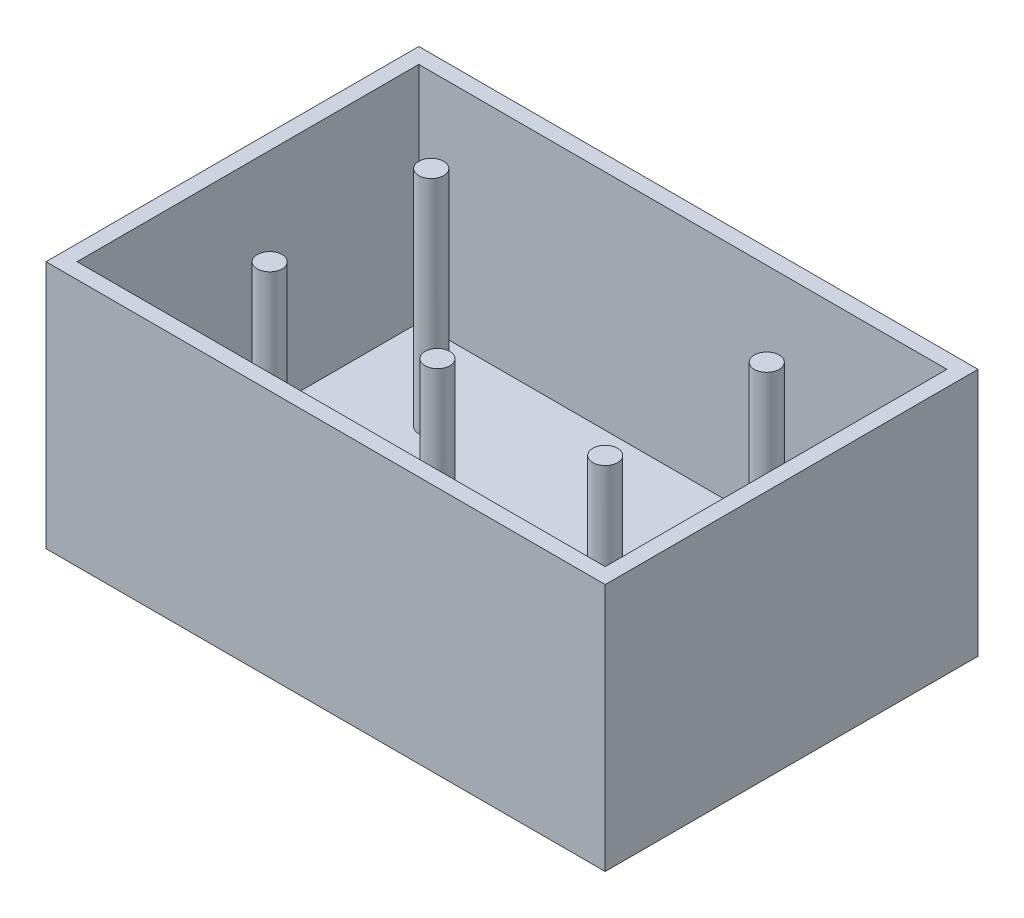
ISO-10303-21;
HEADER;
FILE_DESCRIPTION(('STEP AP214'),'2;1');
FILE_NAME('part.step','',(''),(''),'','','');
FILE_SCHEMA(('AUTOMOTIVE_DESIGN { 1 0 10303 214 1 1 1 1 }'));
ENDSEC;
DATA;
#1=APPLICATION_CONTEXT('core data for automotive mechanical design processes');
#2=APPLICATION_PROTOCOL_DEFINITION('international standard','automotive_design',2000,#1);
#3=PRODUCT_CONTEXT('',#1,'mechanical');
#4=PRODUCT('Part','Part','',(#3));
#5=PRODUCT_RELATED_PRODUCT_CATEGORY('part','',(#4));
#6=PRODUCT_DEFINITION_FORMATION('','',#4);
#7=PRODUCT_DEFINITION_CONTEXT('part definition',#1,'design');
#8=PRODUCT_DEFINITION('design','',#6,#7);
#9=PRODUCT_DEFINITION_SHAPE('','',#8);
#10=(LENGTH_UNIT() NAMED_UNIT(*) SI_UNIT(.MILLI.,.METRE.));
#11=(NAMED_UNIT(*) PLANE_ANGLE_UNIT() SI_UNIT($,.RADIAN.));
#12=(NAMED_UNIT(*) SI_UNIT($,.STERADIAN.) SOLID_ANGLE_UNIT());
#13=UNCERTAINTY_MEASURE_WITH_UNIT(LENGTH_MEASURE(1.E-05),#10,'distance_accuracy_value','');
#14=(GEOMETRIC_REPRESENTATION_CONTEXT(3) GLOBAL_UNCERTAINTY_ASSIGNED_CONTEXT((#13)) GLOBAL_UNIT_ASSIGNED_CONTEXT((#10,
#11,#12)) REPRESENTATION_CONTEXT('',''));
#15=CARTESIAN_POINT('',(0.,0.,0.));
#16=DIRECTION('',(0.,0.,1.));
#17=DIRECTION('',(1.,0.,0.));
#18=AXIS2_PLACEMENT_3D('',#15,#16,#17);
#19=CARTESIAN_POINT('',(57.15,25.4,38.1));
#20=DIRECTION('',(0.,0.,-1.));
#21=DIRECTION('',(-1.,0.,0.));
#22=AXIS2_PLACEMENT_3D('',#19,#20,#21);
#23=PLANE('',#22);
#24=DIRECTION('',(1.,0.,0.));
#25=VECTOR('',#24,1.);
#26=CARTESIAN_POINT('',(57.15,-25.4,38.1));
#27=LINE('',#26,#25);
#28=CARTESIAN_POINT('',(-57.15,-25.4,38.1));
#29=VERTEX_POINT('',#28);
#30=CARTESIAN_POINT('',(57.15,-25.4,38.1));
#31=VERTEX_POINT('',#30);
#32=EDGE_CURVE('E133',#29,#31,#27,.T.);
#33=ORIENTED_EDGE('',*,*,#32,.T.);
#34=DIRECTION('',(0.,-1.,0.));
#35=VECTOR('',#34,1.);
#36=CARTESIAN_POINT('',(57.15,25.4,38.1));
#37=LINE('',#36,#35);
#38=CARTESIAN_POINT('',(57.15,25.4,38.1));
#39=VERTEX_POINT('',#38);
#40=EDGE_CURVE('E175',#39,#31,#37,.T.);
#41=ORIENTED_EDGE('',*,*,#40,.F.);
#42=DIRECTION('',(1.,0.,0.));
#43=VECTOR('',#42,1.);
#44=CARTESIAN_POINT('',(57.15,25.4,38.1));
#45=LINE('',#44,#43);
#46=CARTESIAN_POINT('',(-57.15,25.4,38.1));
#47=VERTEX_POINT('',#46);
#48=EDGE_CURVE('E155',#47,#39,#45,.T.);
#49=ORIENTED_EDGE('',*,*,#48,.F.);
#50=DIRECTION('',(0.,-1.,0.));
#51=VECTOR('',#50,1.);
#52=CARTESIAN_POINT('',(-57.15,25.4,38.1));
#53=LINE('',#52,#51);
#54=EDGE_CURVE('E161',#47,#29,#53,.T.);
#55=ORIENTED_EDGE('',*,*,#54,.T.);
#56=EDGE_LOOP('',(#33,#41,#49,#55));
#57=FACE_BOUND('',#56,.T.);
#58=ADVANCED_FACE('F41',(#57),#23,.F.);
#59=CARTESIAN_POINT('',(57.15,25.4,38.1));
#60=DIRECTION('',(-1.,0.,0.));
#61=DIRECTION('',(0.,0.,1.));
#62=AXIS2_PLACEMENT_3D('',#59,#60,#61);
#63=PLANE('',#62);
#64=DIRECTION('',(0.,0.,-1.));
#65=VECTOR('',#64,1.);
#66=CARTESIAN_POINT('',(57.15,-25.4,38.1));
#67=LINE('',#66,#65);
#68=CARTESIAN_POINT('',(57.15,-25.4,-38.1));
#69=VERTEX_POINT('',#68);
#70=EDGE_CURVE('E164',#31,#69,#67,.T.);
#71=ORIENTED_EDGE('',*,*,#70,.T.);
#72=DIRECTION('',(0.,-1.,0.));
#73=VECTOR('',#72,1.);
#74=CARTESIAN_POINT('',(57.15,25.4,-38.1));
#75=LINE('',#74,#73);
#76=CARTESIAN_POINT('',(57.15,25.4,-38.1));
#77=VERTEX_POINT('',#76);
#78=EDGE_CURVE('E172',#77,#69,#75,.T.);
#79=ORIENTED_EDGE('',*,*,#78,.F.);
#80=DIRECTION('',(0.,0.,-1.));
#81=VECTOR('',#80,1.);
#82=CARTESIAN_POINT('',(57.15,25.4,38.1));
#83=LINE('',#82,#81);
#84=EDGE_CURVE('E93',#39,#77,#83,.T.);
#85=ORIENTED_EDGE('',*,*,#84,.F.);
#86=ORIENTED_EDGE('',*,*,#40,.T.);
#87=EDGE_LOOP('',(#71,#79,#85,#86));
#88=FACE_BOUND('',#87,.T.);
#89=ADVANCED_FACE('F216',(#88),#63,.F.);
#90=CARTESIAN_POINT('',(57.15,25.4,-38.1));
#91=DIRECTION('',(0.,0.,1.));
#92=DIRECTION('',(1.,0.,0.));
#93=AXIS2_PLACEMENT_3D('',#90,#91,#92);
#94=PLANE('',#93);
#95=DIRECTION('',(-1.,0.,0.));
#96=VECTOR('',#95,1.);
#97=CARTESIAN_POINT('',(57.15,-25.4,-38.1));
#98=LINE('',#97,#96);
#99=CARTESIAN_POINT('',(-57.15,-25.4,-38.1));
#100=VERTEX_POINT('',#99);
#101=EDGE_CURVE('E166',#69,#100,#98,.T.);
#102=ORIENTED_EDGE('',*,*,#101,.T.);
#103=DIRECTION('',(0.,-1.,0.));
#104=VECTOR('',#103,1.);
#105=CARTESIAN_POINT('',(-57.15,25.4,-38.1));
#106=LINE('',#105,#104);
#107=CARTESIAN_POINT('',(-57.15,25.4,-38.1));
#108=VERTEX_POINT('',#107);
#109=EDGE_CURVE('E170',#108,#100,#106,.T.);
#110=ORIENTED_EDGE('',*,*,#109,.F.);
#111=DIRECTION('',(-1.,0.,0.));
#112=VECTOR('',#111,1.);
#113=CARTESIAN_POINT('',(57.15,25.4,-38.1));
#114=LINE('',#113,#112);
#115=EDGE_CURVE('E158',#77,#108,#114,.T.);
#116=ORIENTED_EDGE('',*,*,#115,.F.);
#117=ORIENTED_EDGE('',*,*,#78,.T.);
#118=EDGE_LOOP('',(#102,#110,#116,#117));
#119=FACE_BOUND('',#118,.T.);
#120=ADVANCED_FACE('F221',(#119),#94,.F.);
#121=CARTESIAN_POINT('',(-57.15,25.4,38.1));
#122=DIRECTION('',(1.,0.,0.));
#123=DIRECTION('',(0.,0.,-1.));
#124=AXIS2_PLACEMENT_3D('',#121,#122,#123);
#125=PLANE('',#124);
#126=DIRECTION('',(0.,0.,1.));
#127=VECTOR('',#126,1.);
#128=CARTESIAN_POINT('',(-57.15,-25.4,38.1));
#129=LINE('',#128,#127);
#130=EDGE_CURVE('E85',#100,#29,#129,.T.);
#131=ORIENTED_EDGE('',*,*,#130,.T.);
#132=ORIENTED_EDGE('',*,*,#54,.F.);
#133=DIRECTION('',(0.,0.,1.));
#134=VECTOR('',#133,1.);
#135=CARTESIAN_POINT('',(-57.15,25.4,38.1));
#136=LINE('',#135,#134);
#137=EDGE_CURVE('E64',#108,#47,#136,.T.);
#138=ORIENTED_EDGE('',*,*,#137,.F.);
#139=ORIENTED_EDGE('',*,*,#109,.T.);
#140=EDGE_LOOP('',(#131,#132,#138,#139));
#141=FACE_BOUND('',#140,.T.);
#142=ADVANCED_FACE('F232',(#141),#125,.F.);
#143=CARTESIAN_POINT('',(0.,25.4,0.));
#144=DIRECTION('',(0.,-1.,0.));
#145=DIRECTION('',(0.,0.,-1.));
#146=AXIS2_PLACEMENT_3D('',#143,#144,#145);
#147=PLANE('',#146);
#148=DIRECTION('',(-1.,0.,0.));
#149=VECTOR('',#148,1.);
#150=CARTESIAN_POINT('',(-53.975,25.4,-34.925));
#151=LINE('',#150,#149);
#152=CARTESIAN_POINT('',(53.975,25.4,-34.925));
#153=VERTEX_POINT('',#152);
#154=CARTESIAN_POINT('',(-53.975,25.4,-34.925));
#155=VERTEX_POINT('',#154);
#156=EDGE_CURVE('E138',#153,#155,#151,.T.);
#157=ORIENTED_EDGE('',*,*,#156,.F.);
#158=DIRECTION('',(0.,0.,-1.));
#159=VECTOR('',#158,1.);
#160=CARTESIAN_POINT('',(53.975,25.4,34.925));
#161=LINE('',#160,#159);
#162=CARTESIAN_POINT('',(53.975,25.4,34.925));
#163=VERTEX_POINT('',#162);
#164=EDGE_CURVE('E119',#163,#153,#161,.T.);
#165=ORIENTED_EDGE('',*,*,#164,.F.);
#166=DIRECTION('',(1.,0.,0.));
#167=VECTOR('',#166,1.);
#168=CARTESIAN_POINT('',(-53.975,25.4,34.925));
#169=LINE('',#168,#167);
#170=CARTESIAN_POINT('',(-53.975,25.4,34.925));
#171=VERTEX_POINT('',#170);
#172=EDGE_CURVE('E130',#171,#163,#169,.T.);
#173=ORIENTED_EDGE('',*,*,#172,.F.);
#174=DIRECTION('',(0.,0.,1.));
#175=VECTOR('',#174,1.);
#176=CARTESIAN_POINT('',(-53.975,25.4,34.925));
#177=LINE('',#176,#175);
#178=EDGE_CURVE('E55',#155,#171,#177,.T.);
#179=ORIENTED_EDGE('',*,*,#178,.F.);
#180=EDGE_LOOP('',(#157,#165,#173,#179));
#181=FACE_BOUND('',#180,.T.);
#182=ORIENTED_EDGE('',*,*,#48,.T.);
#183=ORIENTED_EDGE('',*,*,#84,.T.);
#184=ORIENTED_EDGE('',*,*,#115,.T.);
#185=ORIENTED_EDGE('',*,*,#137,.T.);
#186=EDGE_LOOP('',(#182,#183,#184,#185));
#187=FACE_BOUND('',#186,.T.);
#188=ADVANCED_FACE('F136',(#181,#187),#147,.F.);
#189=CARTESIAN_POINT('',(0.,-25.4,0.));
#190=DIRECTION('',(0.,-1.,0.));
#191=DIRECTION('',(0.,0.,-1.));
#192=AXIS2_PLACEMENT_3D('',#189,#190,#191);
#193=PLANE('',#192);
#194=ORIENTED_EDGE('',*,*,#32,.F.);
#195=ORIENTED_EDGE('',*,*,#130,.F.);
#196=ORIENTED_EDGE('',*,*,#101,.F.);
#197=ORIENTED_EDGE('',*,*,#70,.F.);
#198=EDGE_LOOP('',(#194,#195,#196,#197));
#199=FACE_BOUND('',#198,.T.);
#200=ADVANCED_FACE('F226',(#199),#193,.T.);
#201=CARTESIAN_POINT('',(53.975,25.401,34.925));
#202=DIRECTION('',(1.,0.,0.));
#203=DIRECTION('',(0.,0.,-1.));
#204=AXIS2_PLACEMENT_3D('',#201,#202,#203);
#205=PLANE('',#204);
#206=ORIENTED_EDGE('',*,*,#164,.T.);
#207=DIRECTION('',(0.,-1.,0.));
#208=VECTOR('',#207,1.);
#209=CARTESIAN_POINT('',(53.975,25.401,-34.925));
#210=LINE('',#209,#208);
#211=CARTESIAN_POINT('',(53.975,-20.32,-34.925));
#212=VERTEX_POINT('',#211);
#213=EDGE_CURVE('E134',#153,#212,#210,.T.);
#214=ORIENTED_EDGE('',*,*,#213,.T.);
#215=DIRECTION('',(0.,0.,1.));
#216=VECTOR('',#215,1.);
#217=CARTESIAN_POINT('',(53.975,-20.32,34.925));
#218=LINE('',#217,#216);
#219=CARTESIAN_POINT('',(53.975,-20.32,34.925));
#220=VERTEX_POINT('',#219);
#221=EDGE_CURVE('E122',#212,#220,#218,.T.);
#222=ORIENTED_EDGE('',*,*,#221,.T.);
#223=DIRECTION('',(0.,-1.,0.));
#224=VECTOR('',#223,1.);
#225=CARTESIAN_POINT('',(53.975,25.401,34.925));
#226=LINE('',#225,#224);
#227=EDGE_CURVE('E115',#163,#220,#226,.T.);
#228=ORIENTED_EDGE('',*,*,#227,.F.);
#229=EDGE_LOOP('',(#206,#214,#222,#228));
#230=FACE_BOUND('',#229,.T.);
#231=ADVANCED_FACE('F117',(#230),#205,.F.);
#232=CARTESIAN_POINT('',(-53.975,25.401,-34.925));
#233=DIRECTION('',(0.,0.,-1.));
#234=DIRECTION('',(-1.,0.,0.));
#235=AXIS2_PLACEMENT_3D('',#232,#233,#234);
#236=PLANE('',#235);
#237=ORIENTED_EDGE('',*,*,#156,.T.);
#238=DIRECTION('',(0.,-1.,0.));
#239=VECTOR('',#238,1.);
#240=CARTESIAN_POINT('',(-53.975,25.401,-34.925));
#241=LINE('',#240,#239);
#242=CARTESIAN_POINT('',(-53.975,-20.32,-34.925));
#243=VERTEX_POINT('',#242);
#244=EDGE_CURVE('E152',#155,#243,#241,.T.);
#245=ORIENTED_EDGE('',*,*,#244,.T.);
#246=DIRECTION('',(1.,0.,0.));
#247=VECTOR('',#246,1.);
#248=CARTESIAN_POINT('',(-53.975,-20.32,-34.925));
#249=LINE('',#248,#247);
#250=EDGE_CURVE('E127',#243,#212,#249,.T.);
#251=ORIENTED_EDGE('',*,*,#250,.T.);
#252=ORIENTED_EDGE('',*,*,#213,.F.);
#253=EDGE_LOOP('',(#237,#245,#251,#252));
#254=FACE_BOUND('',#253,.T.);
#255=ADVANCED_FACE('F205',(#254),#236,.F.);
#256=CARTESIAN_POINT('',(-53.975,25.401,34.925));
#257=DIRECTION('',(-1.,0.,0.));
#258=DIRECTION('',(0.,0.,1.));
#259=AXIS2_PLACEMENT_3D('',#256,#257,#258);
#260=PLANE('',#259);
#261=ORIENTED_EDGE('',*,*,#178,.T.);
#262=DIRECTION('',(0.,-1.,0.));
#263=VECTOR('',#262,1.);
#264=CARTESIAN_POINT('',(-53.975,25.401,34.925));
#265=LINE('',#264,#263);
#266=CARTESIAN_POINT('',(-53.975,-20.32,34.925));
#267=VERTEX_POINT('',#266);
#268=EDGE_CURVE('E126',#171,#267,#265,.T.);
#269=ORIENTED_EDGE('',*,*,#268,.T.);
#270=DIRECTION('',(0.,0.,-1.));
#271=VECTOR('',#270,1.);
#272=CARTESIAN_POINT('',(-53.975,-20.32,34.925));
#273=LINE('',#272,#271);
#274=EDGE_CURVE('E146',#267,#243,#273,.T.);
#275=ORIENTED_EDGE('',*,*,#274,.T.);
#276=ORIENTED_EDGE('',*,*,#244,.F.);
#277=EDGE_LOOP('',(#261,#269,#275,#276));
#278=FACE_BOUND('',#277,.T.);
#279=ADVANCED_FACE('F206',(#278),#260,.F.);
#280=CARTESIAN_POINT('',(-53.975,25.401,34.925));
#281=DIRECTION('',(0.,0.,1.));
#282=DIRECTION('',(1.,0.,0.));
#283=AXIS2_PLACEMENT_3D('',#280,#281,#282);
#284=PLANE('',#283);
#285=ORIENTED_EDGE('',*,*,#172,.T.);
#286=ORIENTED_EDGE('',*,*,#227,.T.);
#287=DIRECTION('',(-1.,0.,0.));
#288=VECTOR('',#287,1.);
#289=CARTESIAN_POINT('',(-53.975,-20.32,34.925));
#290=LINE('',#289,#288);
#291=EDGE_CURVE('E140',#220,#267,#290,.T.);
#292=ORIENTED_EDGE('',*,*,#291,.T.);
#293=ORIENTED_EDGE('',*,*,#268,.F.);
#294=EDGE_LOOP('',(#285,#286,#292,#293));
#295=FACE_BOUND('',#294,.T.);
#296=ADVANCED_FACE('F131',(#295),#284,.F.);
#297=CARTESIAN_POINT('',(0.,-20.32,0.));
#298=DIRECTION('',(0.,-1.,0.));
#299=DIRECTION('',(0.,0.,-1.));
#300=AXIS2_PLACEMENT_3D('',#297,#298,#299);
#301=PLANE('',#300);
#302=CARTESIAN_POINT('',(-34.29,-20.32,-17.78));
#303=DIRECTION('',(0.,-1.,0.));
#304=DIRECTION('',(0.,0.,-1.));
#305=AXIS2_PLACEMENT_3D('',#302,#303,#304);
#306=CIRCLE('',#305,2.54);
#307=CARTESIAN_POINT('',(-34.29,-20.32,-20.32));
#308=VERTEX_POINT('',#307);
#309=EDGE_CURVE('E11',#308,#308,#306,.F.);
#310=ORIENTED_EDGE('',*,*,#309,.F.);
#311=EDGE_LOOP('',(#310));
#312=FACE_BOUND('',#311,.T.);
#313=CARTESIAN_POINT('',(-34.29,-20.32,15.24));
#314=DIRECTION('',(0.,-1.,0.));
#315=DIRECTION('',(0.,0.,-1.));
#316=AXIS2_PLACEMENT_3D('',#313,#314,#315);
#317=CIRCLE('',#316,2.54);
#318=CARTESIAN_POINT('',(-34.29,-20.32,12.7));
#319=VERTEX_POINT('',#318);
#320=EDGE_CURVE('E48',#319,#319,#317,.F.);
#321=ORIENTED_EDGE('',*,*,#320,.F.);
#322=EDGE_LOOP('',(#321));
#323=FACE_BOUND('',#322,.T.);
#324=CARTESIAN_POINT('',(0.,-20.32,15.24));
#325=DIRECTION('',(0.,-1.,0.));
#326=DIRECTION('',(0.,0.,-1.));
#327=AXIS2_PLACEMENT_3D('',#324,#325,#326);
#328=CIRCLE('',#327,2.54);
#329=CARTESIAN_POINT('',(0.,-20.32,12.7));
#330=VERTEX_POINT('',#329);
#331=EDGE_CURVE('E183',#330,#330,#328,.F.);
#332=ORIENTED_EDGE('',*,*,#331,.F.);
#333=EDGE_LOOP('',(#332));
#334=FACE_BOUND('',#333,.T.);
#335=CARTESIAN_POINT('',(34.29,-20.32,15.24));
#336=DIRECTION('',(0.,-1.,0.));
#337=DIRECTION('',(0.,0.,-1.));
#338=AXIS2_PLACEMENT_3D('',#335,#336,#337);
#339=CIRCLE('',#338,2.54);
#340=CARTESIAN_POINT('',(34.29,-20.32,12.7));
#341=VERTEX_POINT('',#340);
#342=EDGE_CURVE('E180',#341,#341,#339,.F.);
#343=ORIENTED_EDGE('',*,*,#342,.F.);
#344=EDGE_LOOP('',(#343));
#345=FACE_BOUND('',#344,.T.);
#346=CARTESIAN_POINT('',(34.29,-20.32,-17.78));
#347=DIRECTION('',(0.,-1.,0.));
#348=DIRECTION('',(0.,0.,-1.));
#349=AXIS2_PLACEMENT_3D('',#346,#347,#348);
#350=CIRCLE('',#349,2.54);
#351=CARTESIAN_POINT('',(34.29,-20.32,-20.32));
#352=VERTEX_POINT('',#351);
#353=EDGE_CURVE('E177',#352,#352,#350,.F.);
#354=ORIENTED_EDGE('',*,*,#353,.F.);
#355=EDGE_LOOP('',(#354));
#356=FACE_BOUND('',#355,.T.);
#357=ORIENTED_EDGE('',*,*,#221,.F.);
#358=ORIENTED_EDGE('',*,*,#250,.F.);
#359=ORIENTED_EDGE('',*,*,#274,.F.);
#360=ORIENTED_EDGE('',*,*,#291,.F.);
#361=EDGE_LOOP('',(#357,#358,#359,#360));
#362=FACE_BOUND('',#361,.T.);
#363=ADVANCED_FACE('F190',(#312,#323,#334,#345,#356,#362),#301,.F.);
#364=CARTESIAN_POINT('',(34.29,25.4,-17.78));
#365=DIRECTION('',(0.,-1.,0.));
#366=DIRECTION('',(0.,0.,-1.));
#367=AXIS2_PLACEMENT_3D('',#364,#365,#366);
#368=CYLINDRICAL_SURFACE('',#367,2.54);
#369=CARTESIAN_POINT('',(34.29,25.4,-17.78));
#370=DIRECTION('',(0.,1.,0.));
#371=DIRECTION('',(0.,0.,1.));
#372=AXIS2_PLACEMENT_3D('',#369,#370,#371);
#373=CIRCLE('',#372,2.54);
#374=CARTESIAN_POINT('',(34.29,25.4,-15.24));
#375=VERTEX_POINT('',#374);
#376=EDGE_CURVE('E458',#375,#375,#373,.T.);
#377=ORIENTED_EDGE('',*,*,#376,.F.);
#378=EDGE_LOOP('',(#377));
#379=FACE_BOUND('',#378,.T.);
#380=ORIENTED_EDGE('',*,*,#353,.T.);
#381=EDGE_LOOP('',(#380));
#382=FACE_BOUND('',#381,.T.);
#383=ADVANCED_FACE('F193',(#379,#382),#368,.T.);
#384=CARTESIAN_POINT('',(34.29,25.4,-17.78));
#385=DIRECTION('',(0.,1.,0.));
#386=DIRECTION('',(0.,0.,1.));
#387=AXIS2_PLACEMENT_3D('',#384,#385,#386);
#388=PLANE('',#387);
#389=ORIENTED_EDGE('',*,*,#376,.T.);
#390=EDGE_LOOP('',(#389));
#391=FACE_BOUND('',#390,.T.);
#392=ADVANCED_FACE('F307',(#391),#388,.T.);
#393=CARTESIAN_POINT('',(34.29,25.4,15.24));
#394=DIRECTION('',(0.,-1.,0.));
#395=DIRECTION('',(0.,0.,-1.));
#396=AXIS2_PLACEMENT_3D('',#393,#394,#395);
#397=CYLINDRICAL_SURFACE('',#396,2.54);
#398=CARTESIAN_POINT('',(34.29,25.4,15.24));
#399=DIRECTION('',(0.,1.,0.));
#400=DIRECTION('',(0.,0.,1.));
#401=AXIS2_PLACEMENT_3D('',#398,#399,#400);
#402=CIRCLE('',#401,2.54);
#403=CARTESIAN_POINT('',(34.29,25.4,17.78));
#404=VERTEX_POINT('',#403);
#405=EDGE_CURVE('E455',#404,#404,#402,.T.);
#406=ORIENTED_EDGE('',*,*,#405,.F.);
#407=EDGE_LOOP('',(#406));
#408=FACE_BOUND('',#407,.T.);
#409=ORIENTED_EDGE('',*,*,#342,.T.);
#410=EDGE_LOOP('',(#409));
#411=FACE_BOUND('',#410,.T.);
#412=ADVANCED_FACE('F318',(#408,#411),#397,.T.);
#413=CARTESIAN_POINT('',(34.29,25.4,15.24));
#414=DIRECTION('',(0.,1.,0.));
#415=DIRECTION('',(0.,0.,1.));
#416=AXIS2_PLACEMENT_3D('',#413,#414,#415);
#417=PLANE('',#416);
#418=ORIENTED_EDGE('',*,*,#405,.T.);
#419=EDGE_LOOP('',(#418));
#420=FACE_BOUND('',#419,.T.);
#421=ADVANCED_FACE('F329',(#420),#417,.T.);
#422=CARTESIAN_POINT('',(0.,25.4,15.24));
#423=DIRECTION('',(0.,-1.,0.));
#424=DIRECTION('',(0.,0.,-1.));
#425=AXIS2_PLACEMENT_3D('',#422,#423,#424);
#426=CYLINDRICAL_SURFACE('',#425,2.54);
#427=CARTESIAN_POINT('',(0.,25.4,15.24));
#428=DIRECTION('',(0.,1.,0.));
#429=DIRECTION('',(0.,0.,1.));
#430=AXIS2_PLACEMENT_3D('',#427,#428,#429);
#431=CIRCLE('',#430,2.54);
#432=CARTESIAN_POINT('',(0.,25.4,17.78));
#433=VERTEX_POINT('',#432);
#434=EDGE_CURVE('E450',#433,#433,#431,.T.);
#435=ORIENTED_EDGE('',*,*,#434,.F.);
#436=EDGE_LOOP('',(#435));
#437=FACE_BOUND('',#436,.T.);
#438=ORIENTED_EDGE('',*,*,#331,.T.);
#439=EDGE_LOOP('',(#438));
#440=FACE_BOUND('',#439,.T.);
#441=ADVANCED_FACE('F340',(#437,#440),#426,.T.);
#442=CARTESIAN_POINT('',(0.,25.4,15.24));
#443=DIRECTION('',(0.,1.,0.));
#444=DIRECTION('',(0.,0.,1.));
#445=AXIS2_PLACEMENT_3D('',#442,#443,#444);
#446=PLANE('',#445);
#447=ORIENTED_EDGE('',*,*,#434,.T.);
#448=EDGE_LOOP('',(#447));
#449=FACE_BOUND('',#448,.T.);
#450=ADVANCED_FACE('F351',(#449),#446,.T.);
#451=CARTESIAN_POINT('',(-34.29,25.4,15.24));
#452=DIRECTION('',(0.,-1.,0.));
#453=DIRECTION('',(0.,0.,-1.));
#454=AXIS2_PLACEMENT_3D('',#451,#452,#453);
#455=CYLINDRICAL_SURFACE('',#454,2.54);
#456=CARTESIAN_POINT('',(-34.29,25.4,15.24));
#457=DIRECTION('',(0.,1.,0.));
#458=DIRECTION('',(0.,0.,1.));
#459=AXIS2_PLACEMENT_3D('',#456,#457,#458);
#460=CIRCLE('',#459,2.54);
#461=CARTESIAN_POINT('',(-34.29,25.4,17.78));
#462=VERTEX_POINT('',#461);
#463=EDGE_CURVE('E447',#462,#462,#460,.T.);
#464=ORIENTED_EDGE('',*,*,#463,.F.);
#465=EDGE_LOOP('',(#464));
#466=FACE_BOUND('',#465,.T.);
#467=ORIENTED_EDGE('',*,*,#320,.T.);
#468=EDGE_LOOP('',(#467));
#469=FACE_BOUND('',#468,.T.);
#470=ADVANCED_FACE('F188',(#466,#469),#455,.T.);
#471=CARTESIAN_POINT('',(-34.29,25.4,15.24));
#472=DIRECTION('',(0.,1.,0.));
#473=DIRECTION('',(0.,0.,1.));
#474=AXIS2_PLACEMENT_3D('',#471,#472,#473);
#475=PLANE('',#474);
#476=ORIENTED_EDGE('',*,*,#463,.T.);
#477=EDGE_LOOP('',(#476));
#478=FACE_BOUND('',#477,.T.);
#479=ADVANCED_FACE('F372',(#478),#475,.T.);
#480=CARTESIAN_POINT('',(-34.29,25.4,-17.78));
#481=DIRECTION('',(0.,-1.,0.));
#482=DIRECTION('',(0.,0.,-1.));
#483=AXIS2_PLACEMENT_3D('',#480,#481,#482);
#484=CYLINDRICAL_SURFACE('',#483,2.54);
#485=CARTESIAN_POINT('',(-34.29,25.4,-17.78));
#486=DIRECTION('',(0.,1.,0.));
#487=DIRECTION('',(0.,0.,1.));
#488=AXIS2_PLACEMENT_3D('',#485,#486,#487);
#489=CIRCLE('',#488,2.54);
#490=CARTESIAN_POINT('',(-34.29,25.4,-15.24));
#491=VERTEX_POINT('',#490);
#492=EDGE_CURVE('E446',#491,#491,#489,.T.);
#493=ORIENTED_EDGE('',*,*,#492,.F.);
#494=EDGE_LOOP('',(#493));
#495=FACE_BOUND('',#494,.T.);
#496=ORIENTED_EDGE('',*,*,#309,.T.);
#497=EDGE_LOOP('',(#496));
#498=FACE_BOUND('',#497,.T.);
#499=ADVANCED_FACE('F383',(#495,#498),#484,.T.);
#500=CARTESIAN_POINT('',(-34.29,25.4,-17.78));
#501=DIRECTION('',(0.,1.,0.));
#502=DIRECTION('',(0.,0.,1.));
#503=AXIS2_PLACEMENT_3D('',#500,#501,#502);
#504=PLANE('',#503);
#505=ORIENTED_EDGE('',*,*,#492,.T.);
#506=EDGE_LOOP('',(#505));
#507=FACE_BOUND('',#506,.T.);
#508=ADVANCED_FACE('F394',(#507),#504,.T.);
#509=CLOSED_SHELL('',(#58,#89,#120,#142,#188,#200,#231,#255,#279,#296,#363,#383,#392,#412,#421,
#441,#450,#470,#479,#499,#508));
#510=MANIFOLD_SOLID_BREP('B2',#509);
#511=ADVANCED_BREP_SHAPE_REPRESENTATION('',(#18,#510),#14);
#512=SHAPE_DEFINITION_REPRESENTATION(#9,#511);
ENDSEC;
END-ISO-10303-21;
